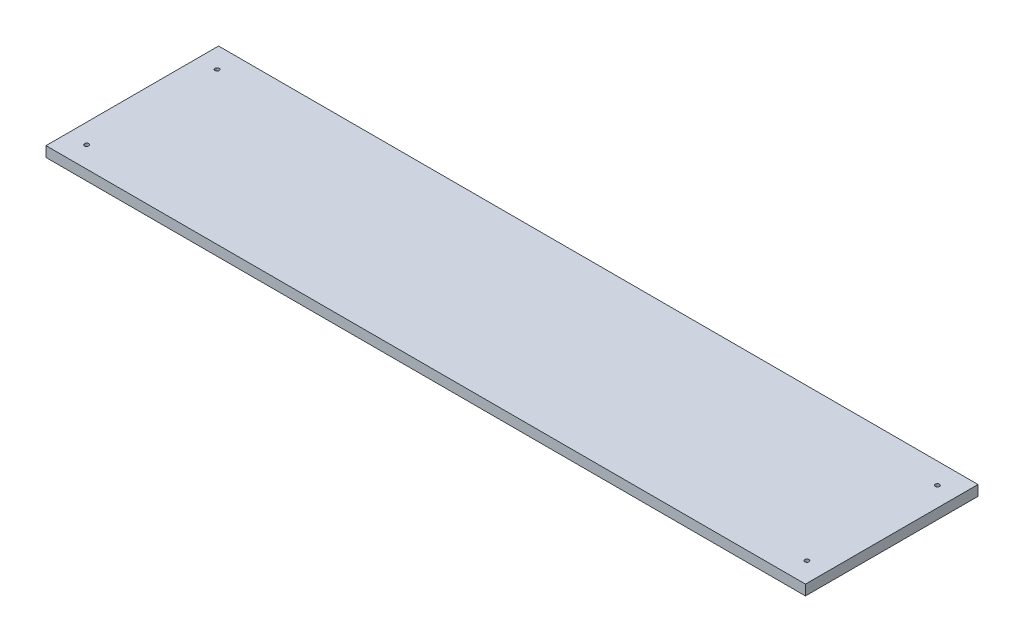
ISO-10303-21;
HEADER;
FILE_DESCRIPTION(('STEP AP214'),'2;1');
FILE_NAME('part.step','',(''),(''),'','','');
FILE_SCHEMA(('AUTOMOTIVE_DESIGN { 1 0 10303 214 1 1 1 1 }'));
ENDSEC;
DATA;
#1=APPLICATION_CONTEXT('core data for automotive mechanical design processes');
#2=APPLICATION_PROTOCOL_DEFINITION('international standard','automotive_design',2000,#1);
#3=PRODUCT_CONTEXT('',#1,'mechanical');
#4=PRODUCT('Part','Part','',(#3));
#5=PRODUCT_RELATED_PRODUCT_CATEGORY('part','',(#4));
#6=PRODUCT_DEFINITION_FORMATION('','',#4);
#7=PRODUCT_DEFINITION_CONTEXT('part definition',#1,'design');
#8=PRODUCT_DEFINITION('design','',#6,#7);
#9=PRODUCT_DEFINITION_SHAPE('','',#8);
#10=(LENGTH_UNIT() NAMED_UNIT(*) SI_UNIT(.MILLI.,.METRE.));
#11=(NAMED_UNIT(*) PLANE_ANGLE_UNIT() SI_UNIT($,.RADIAN.));
#12=(NAMED_UNIT(*) SI_UNIT($,.STERADIAN.) SOLID_ANGLE_UNIT());
#13=UNCERTAINTY_MEASURE_WITH_UNIT(LENGTH_MEASURE(1.E-05),#10,'distance_accuracy_value','');
#14=(GEOMETRIC_REPRESENTATION_CONTEXT(3) GLOBAL_UNCERTAINTY_ASSIGNED_CONTEXT((#13)) GLOBAL_UNIT_ASSIGNED_CONTEXT((#10,
#11,#12)) REPRESENTATION_CONTEXT('',''));
#15=CARTESIAN_POINT('',(0.,0.,0.));
#16=DIRECTION('',(0.,0.,1.));
#17=DIRECTION('',(1.,0.,0.));
#18=AXIS2_PLACEMENT_3D('',#15,#16,#17);
#19=CARTESIAN_POINT('',(0.,10.,0.));
#20=DIRECTION('',(0.,1.,0.));
#21=DIRECTION('',(0.,0.,1.));
#22=AXIS2_PLACEMENT_3D('',#19,#20,#21);
#23=PLANE('',#22);
#24=CARTESIAN_POINT('',(385.07374301676,10.,-46.4614525139665));
#25=DIRECTION('',(0.,1.,0.));
#26=DIRECTION('',(0.,0.,1.));
#27=AXIS2_PLACEMENT_3D('',#24,#25,#26);
#28=CIRCLE('',#27,2.);
#29=CARTESIAN_POINT('',(385.07374301676,10.,-44.4614525139665));
#30=VERTEX_POINT('',#29);
#31=EDGE_CURVE('E691',#30,#30,#28,.T.);
#32=ORIENTED_EDGE('',*,*,#31,.F.);
#33=EDGE_LOOP('',(#32));
#34=FACE_BOUND('',#33,.T.);
#35=CARTESIAN_POINT('',(385.07374301676,10.,-173.061452513967));
#36=DIRECTION('',(0.,-1.,0.));
#37=DIRECTION('',(0.,0.,-1.));
#38=AXIS2_PLACEMENT_3D('',#35,#36,#37);
#39=CIRCLE('',#38,2.);
#40=CARTESIAN_POINT('',(385.07374301676,10.,-175.061452513967));
#41=VERTEX_POINT('',#40);
#42=EDGE_CURVE('E682',#41,#41,#39,.T.);
#43=ORIENTED_EDGE('',*,*,#42,.T.);
#44=EDGE_LOOP('',(#43));
#45=FACE_BOUND('',#44,.T.);
#46=DIRECTION('',(0.,0.,1.));
#47=VECTOR('',#46,1.);
#48=CARTESIAN_POINT('',(-332.72625698324,10.,-193.461452513966));
#49=LINE('',#48,#47);
#50=CARTESIAN_POINT('',(-332.72625698324,10.,-193.461452513966));
#51=VERTEX_POINT('',#50);
#52=CARTESIAN_POINT('',(-332.72625698324,10.,-26.0614525139665));
#53=VERTEX_POINT('',#52);
#54=EDGE_CURVE('E356',#51,#53,#49,.T.);
#55=ORIENTED_EDGE('',*,*,#54,.T.);
#56=DIRECTION('',(1.,0.,0.));
#57=VECTOR('',#56,1.);
#58=CARTESIAN_POINT('',(-332.72625698324,10.,-26.0614525139665));
#59=LINE('',#58,#57);
#60=CARTESIAN_POINT('',(404.07374301676,10.,-26.0614525139665));
#61=VERTEX_POINT('',#60);
#62=EDGE_CURVE('E360',#53,#61,#59,.T.);
#63=ORIENTED_EDGE('',*,*,#62,.T.);
#64=DIRECTION('',(0.,0.,-1.));
#65=VECTOR('',#64,1.);
#66=CARTESIAN_POINT('',(404.07374301676,10.,-193.461452513966));
#67=LINE('',#66,#65);
#68=CARTESIAN_POINT('',(404.07374301676,10.,-193.461452513966));
#69=VERTEX_POINT('',#68);
#70=EDGE_CURVE('E364',#61,#69,#67,.T.);
#71=ORIENTED_EDGE('',*,*,#70,.T.);
#72=DIRECTION('',(-1.,0.,0.));
#73=VECTOR('',#72,1.);
#74=CARTESIAN_POINT('',(-332.72625698324,10.,-193.461452513966));
#75=LINE('',#74,#73);
#76=EDGE_CURVE('E367',#69,#51,#75,.T.);
#77=ORIENTED_EDGE('',*,*,#76,.T.);
#78=EDGE_LOOP('',(#55,#63,#71,#77));
#79=FACE_BOUND('',#78,.T.);
#80=CARTESIAN_POINT('',(-313.72625698324,10.,-46.4614525139665));
#81=DIRECTION('',(0.,-1.,0.));
#82=DIRECTION('',(0.,0.,-1.));
#83=AXIS2_PLACEMENT_3D('',#80,#81,#82);
#84=CIRCLE('',#83,2.);
#85=CARTESIAN_POINT('',(-313.72625698324,10.,-48.4614525139665));
#86=VERTEX_POINT('',#85);
#87=EDGE_CURVE('E671',#86,#86,#84,.T.);
#88=ORIENTED_EDGE('',*,*,#87,.T.);
#89=EDGE_LOOP('',(#88));
#90=FACE_BOUND('',#89,.T.);
#91=CARTESIAN_POINT('',(-313.72625698324,10.,-173.061452513967));
#92=DIRECTION('',(0.,1.,0.));
#93=DIRECTION('',(0.,0.,1.));
#94=AXIS2_PLACEMENT_3D('',#91,#92,#93);
#95=CIRCLE('',#94,2.);
#96=CARTESIAN_POINT('',(-313.72625698324,10.,-171.061452513967));
#97=VERTEX_POINT('',#96);
#98=EDGE_CURVE('E674',#97,#97,#95,.T.);
#99=ORIENTED_EDGE('',*,*,#98,.F.);
#100=EDGE_LOOP('',(#99));
#101=FACE_BOUND('',#100,.T.);
#102=ADVANCED_FACE('F71',(#34,#45,#79,#90,#101),#23,.T.);
#103=CARTESIAN_POINT('',(0.,5.,0.));
#104=DIRECTION('',(0.,-1.,0.));
#105=DIRECTION('',(0.,0.,-1.));
#106=AXIS2_PLACEMENT_3D('',#103,#104,#105);
#107=PLANE('',#106);
#108=CARTESIAN_POINT('',(385.07374301676,5.,-46.4614525139665));
#109=DIRECTION('',(0.,-1.,0.));
#110=DIRECTION('',(0.,0.,-1.));
#111=AXIS2_PLACEMENT_3D('',#108,#109,#110);
#112=CIRCLE('',#111,3.99999999999999);
#113=CARTESIAN_POINT('',(385.07374301676,5.,-50.4614525139665));
#114=VERTEX_POINT('',#113);
#115=EDGE_CURVE('E275',#114,#114,#112,.F.);
#116=ORIENTED_EDGE('',*,*,#115,.T.);
#117=EDGE_LOOP('',(#116));
#118=FACE_BOUND('',#117,.T.);
#119=CARTESIAN_POINT('',(-313.72625698324,5.,-173.061452513967));
#120=DIRECTION('',(0.,-1.,0.));
#121=DIRECTION('',(0.,0.,-1.));
#122=AXIS2_PLACEMENT_3D('',#119,#120,#121);
#123=CIRCLE('',#122,3.99999999999999);
#124=CARTESIAN_POINT('',(-313.72625698324,5.,-177.061452513967));
#125=VERTEX_POINT('',#124);
#126=EDGE_CURVE('E496',#125,#125,#123,.F.);
#127=ORIENTED_EDGE('',*,*,#126,.T.);
#128=EDGE_LOOP('',(#127));
#129=FACE_BOUND('',#128,.T.);
#130=DIRECTION('',(0.,0.,-1.));
#131=VECTOR('',#130,1.);
#132=CARTESIAN_POINT('',(-321.22625698324,5.,-37.5614525139665));
#133=LINE('',#132,#131);
#134=CARTESIAN_POINT('',(-321.22625698324,5.,-37.5614525139665));
#135=VERTEX_POINT('',#134);
#136=CARTESIAN_POINT('',(-321.22625698324,5.,-178.961452513966));
#137=VERTEX_POINT('',#136);
#138=EDGE_CURVE('E250',#135,#137,#133,.T.);
#139=ORIENTED_EDGE('',*,*,#138,.T.);
#140=CARTESIAN_POINT('',(-318.22625698324,5.,-178.961452513966));
#141=DIRECTION('',(0.,-1.,0.));
#142=DIRECTION('',(0.,0.,-1.));
#143=AXIS2_PLACEMENT_3D('',#140,#141,#142);
#144=CIRCLE('',#143,3.);
#145=CARTESIAN_POINT('',(-318.22625698324,5.,-181.961452513966));
#146=VERTEX_POINT('',#145);
#147=EDGE_CURVE('E245',#137,#146,#144,.T.);
#148=ORIENTED_EDGE('',*,*,#147,.T.);
#149=DIRECTION('',(1.,0.,0.));
#150=VECTOR('',#149,1.);
#151=CARTESIAN_POINT('',(-321.22625698324,5.,-181.961452513966));
#152=LINE('',#151,#150);
#153=CARTESIAN_POINT('',(392.57374301676,5.,-181.961452513966));
#154=VERTEX_POINT('',#153);
#155=EDGE_CURVE('E235',#146,#154,#152,.T.);
#156=ORIENTED_EDGE('',*,*,#155,.T.);
#157=DIRECTION('',(0.,0.,1.));
#158=VECTOR('',#157,1.);
#159=CARTESIAN_POINT('',(392.57374301676,5.,-37.5614525139665));
#160=LINE('',#159,#158);
#161=CARTESIAN_POINT('',(392.57374301676,5.,-37.5614525139665));
#162=VERTEX_POINT('',#161);
#163=EDGE_CURVE('E242',#154,#162,#160,.T.);
#164=ORIENTED_EDGE('',*,*,#163,.T.);
#165=DIRECTION('',(-1.,0.,0.));
#166=VECTOR('',#165,1.);
#167=CARTESIAN_POINT('',(-321.22625698324,5.,-37.5614525139665));
#168=LINE('',#167,#166);
#169=EDGE_CURVE('E262',#162,#135,#168,.T.);
#170=ORIENTED_EDGE('',*,*,#169,.T.);
#171=EDGE_LOOP('',(#139,#148,#156,#164,#170));
#172=FACE_BOUND('',#171,.T.);
#173=CARTESIAN_POINT('',(-313.72625698324,5.,-46.4614525139665));
#174=DIRECTION('',(0.,-1.,0.));
#175=DIRECTION('',(0.,0.,-1.));
#176=AXIS2_PLACEMENT_3D('',#173,#174,#175);
#177=CIRCLE('',#176,3.99999999999999);
#178=CARTESIAN_POINT('',(-313.72625698324,5.,-50.4614525139665));
#179=VERTEX_POINT('',#178);
#180=EDGE_CURVE('E80',#179,#179,#177,.T.);
#181=ORIENTED_EDGE('',*,*,#180,.F.);
#182=EDGE_LOOP('',(#181));
#183=FACE_BOUND('',#182,.T.);
#184=CARTESIAN_POINT('',(385.07374301676,5.,-173.061452513967));
#185=DIRECTION('',(0.,-1.,0.));
#186=DIRECTION('',(0.,0.,-1.));
#187=AXIS2_PLACEMENT_3D('',#184,#185,#186);
#188=CIRCLE('',#187,3.99999999999999);
#189=CARTESIAN_POINT('',(385.07374301676,5.,-177.061452513967));
#190=VERTEX_POINT('',#189);
#191=EDGE_CURVE('E12',#190,#190,#188,.T.);
#192=ORIENTED_EDGE('',*,*,#191,.F.);
#193=EDGE_LOOP('',(#192));
#194=FACE_BOUND('',#193,.T.);
#195=ADVANCED_FACE('F238',(#118,#129,#172,#183,#194),#107,.T.);
#196=CARTESIAN_POINT('',(-332.72625698324,10.,-193.461452513966));
#197=DIRECTION('',(1.,0.,0.));
#198=DIRECTION('',(0.,0.,-1.));
#199=AXIS2_PLACEMENT_3D('',#196,#197,#198);
#200=PLANE('',#199);
#201=DIRECTION('',(0.,0.,1.));
#202=VECTOR('',#201,1.);
#203=CARTESIAN_POINT('',(-332.72625698324,0.,-193.461452513966));
#204=LINE('',#203,#202);
#205=CARTESIAN_POINT('',(-332.72625698324,0.,-193.461452513966));
#206=VERTEX_POINT('',#205);
#207=CARTESIAN_POINT('',(-332.72625698324,0.,-26.0614525139665));
#208=VERTEX_POINT('',#207);
#209=EDGE_CURVE('E342',#206,#208,#204,.T.);
#210=ORIENTED_EDGE('',*,*,#209,.T.);
#211=DIRECTION('',(0.,-1.,0.));
#212=VECTOR('',#211,1.);
#213=CARTESIAN_POINT('',(-332.72625698324,10.,-26.0614525139665));
#214=LINE('',#213,#212);
#215=EDGE_CURVE('E393',#53,#208,#214,.T.);
#216=ORIENTED_EDGE('',*,*,#215,.F.);
#217=ORIENTED_EDGE('',*,*,#54,.F.);
#218=DIRECTION('',(0.,-1.,0.));
#219=VECTOR('',#218,1.);
#220=CARTESIAN_POINT('',(-332.72625698324,10.,-193.461452513966));
#221=LINE('',#220,#219);
#222=EDGE_CURVE('E370',#51,#206,#221,.T.);
#223=ORIENTED_EDGE('',*,*,#222,.T.);
#224=EDGE_LOOP('',(#210,#216,#217,#223));
#225=FACE_BOUND('',#224,.T.);
#226=ADVANCED_FACE('F511',(#225),#200,.F.);
#227=CARTESIAN_POINT('',(-332.72625698324,10.,-26.0614525139665));
#228=DIRECTION('',(0.,0.,-1.));
#229=DIRECTION('',(-1.,0.,0.));
#230=AXIS2_PLACEMENT_3D('',#227,#228,#229);
#231=PLANE('',#230);
#232=DIRECTION('',(1.,0.,0.));
#233=VECTOR('',#232,1.);
#234=CARTESIAN_POINT('',(-332.72625698324,0.,-26.0614525139665));
#235=LINE('',#234,#233);
#236=CARTESIAN_POINT('',(404.07374301676,0.,-26.0614525139665));
#237=VERTEX_POINT('',#236);
#238=EDGE_CURVE('E374',#208,#237,#235,.T.);
#239=ORIENTED_EDGE('',*,*,#238,.T.);
#240=DIRECTION('',(0.,-1.,0.));
#241=VECTOR('',#240,1.);
#242=CARTESIAN_POINT('',(404.07374301676,10.,-26.0614525139665));
#243=LINE('',#242,#241);
#244=EDGE_CURVE('E389',#61,#237,#243,.T.);
#245=ORIENTED_EDGE('',*,*,#244,.F.);
#246=ORIENTED_EDGE('',*,*,#62,.F.);
#247=ORIENTED_EDGE('',*,*,#215,.T.);
#248=EDGE_LOOP('',(#239,#245,#246,#247));
#249=FACE_BOUND('',#248,.T.);
#250=ADVANCED_FACE('F594',(#249),#231,.F.);
#251=CARTESIAN_POINT('',(404.07374301676,10.,-193.461452513966));
#252=DIRECTION('',(-1.,0.,0.));
#253=DIRECTION('',(0.,0.,1.));
#254=AXIS2_PLACEMENT_3D('',#251,#252,#253);
#255=PLANE('',#254);
#256=DIRECTION('',(0.,0.,-1.));
#257=VECTOR('',#256,1.);
#258=CARTESIAN_POINT('',(404.07374301676,0.,-193.461452513966));
#259=LINE('',#258,#257);
#260=CARTESIAN_POINT('',(404.07374301676,0.,-193.461452513966));
#261=VERTEX_POINT('',#260);
#262=EDGE_CURVE('E377',#237,#261,#259,.T.);
#263=ORIENTED_EDGE('',*,*,#262,.T.);
#264=DIRECTION('',(0.,-1.,0.));
#265=VECTOR('',#264,1.);
#266=CARTESIAN_POINT('',(404.07374301676,10.,-193.461452513966));
#267=LINE('',#266,#265);
#268=EDGE_CURVE('E385',#69,#261,#267,.T.);
#269=ORIENTED_EDGE('',*,*,#268,.F.);
#270=ORIENTED_EDGE('',*,*,#70,.F.);
#271=ORIENTED_EDGE('',*,*,#244,.T.);
#272=EDGE_LOOP('',(#263,#269,#270,#271));
#273=FACE_BOUND('',#272,.T.);
#274=ADVANCED_FACE('F590',(#273),#255,.F.);
#275=CARTESIAN_POINT('',(-332.72625698324,10.,-193.461452513966));
#276=DIRECTION('',(0.,0.,1.));
#277=DIRECTION('',(1.,0.,0.));
#278=AXIS2_PLACEMENT_3D('',#275,#276,#277);
#279=PLANE('',#278);
#280=DIRECTION('',(-1.,0.,0.));
#281=VECTOR('',#280,1.);
#282=CARTESIAN_POINT('',(-332.72625698324,0.,-193.461452513966));
#283=LINE('',#282,#281);
#284=EDGE_CURVE('E361',#261,#206,#283,.T.);
#285=ORIENTED_EDGE('',*,*,#284,.T.);
#286=ORIENTED_EDGE('',*,*,#222,.F.);
#287=ORIENTED_EDGE('',*,*,#76,.F.);
#288=ORIENTED_EDGE('',*,*,#268,.T.);
#289=EDGE_LOOP('',(#285,#286,#287,#288));
#290=FACE_BOUND('',#289,.T.);
#291=ADVANCED_FACE('F587',(#290),#279,.F.);
#292=CARTESIAN_POINT('',(0.,0.,0.));
#293=DIRECTION('',(0.,1.,0.));
#294=DIRECTION('',(0.,0.,1.));
#295=AXIS2_PLACEMENT_3D('',#292,#293,#294);
#296=PLANE('',#295);
#297=DIRECTION('',(1.,0.,0.));
#298=VECTOR('',#297,1.);
#299=CARTESIAN_POINT('',(-327.72625698324,0.,-189.961452513966));
#300=LINE('',#299,#298);
#301=CARTESIAN_POINT('',(-326.22625698324,0.,-189.961452513966));
#302=VERTEX_POINT('',#301);
#303=CARTESIAN_POINT('',(397.57374301676,0.,-189.961452513966));
#304=VERTEX_POINT('',#303);
#305=EDGE_CURVE('E346',#302,#304,#300,.T.);
#306=ORIENTED_EDGE('',*,*,#305,.F.);
#307=CARTESIAN_POINT('',(-326.22625698324,0.,-186.961452513966));
#308=DIRECTION('',(0.,1.,0.));
#309=DIRECTION('',(0.,0.,1.));
#310=AXIS2_PLACEMENT_3D('',#307,#308,#309);
#311=CIRCLE('',#310,3.);
#312=CARTESIAN_POINT('',(-329.22625698324,0.,-186.961452513966));
#313=VERTEX_POINT('',#312);
#314=EDGE_CURVE('E477',#302,#313,#311,.T.);
#315=ORIENTED_EDGE('',*,*,#314,.T.);
#316=DIRECTION('',(0.,0.,-1.));
#317=VECTOR('',#316,1.);
#318=CARTESIAN_POINT('',(-329.22625698324,0.,-31.0614525139665));
#319=LINE('',#318,#317);
#320=CARTESIAN_POINT('',(-329.22625698324,0.,-32.5614525139665));
#321=VERTEX_POINT('',#320);
#322=EDGE_CURVE('E324',#321,#313,#319,.T.);
#323=ORIENTED_EDGE('',*,*,#322,.F.);
#324=CARTESIAN_POINT('',(-326.22625698324,0.,-32.5614525139665));
#325=DIRECTION('',(0.,1.,0.));
#326=DIRECTION('',(0.,0.,1.));
#327=AXIS2_PLACEMENT_3D('',#324,#325,#326);
#328=CIRCLE('',#327,3.);
#329=CARTESIAN_POINT('',(-326.22625698324,0.,-29.5614525139665));
#330=VERTEX_POINT('',#329);
#331=EDGE_CURVE('E480',#321,#330,#328,.T.);
#332=ORIENTED_EDGE('',*,*,#331,.T.);
#333=DIRECTION('',(-1.,0.,0.));
#334=VECTOR('',#333,1.);
#335=CARTESIAN_POINT('',(-327.72625698324,0.,-29.5614525139665));
#336=LINE('',#335,#334);
#337=CARTESIAN_POINT('',(397.57374301676,0.,-29.5614525139665));
#338=VERTEX_POINT('',#337);
#339=EDGE_CURVE('E330',#338,#330,#336,.T.);
#340=ORIENTED_EDGE('',*,*,#339,.F.);
#341=CARTESIAN_POINT('',(397.57374301676,0.,-32.5614525139665));
#342=DIRECTION('',(0.,1.,0.));
#343=DIRECTION('',(0.,0.,1.));
#344=AXIS2_PLACEMENT_3D('',#341,#342,#343);
#345=CIRCLE('',#344,3.);
#346=CARTESIAN_POINT('',(400.57374301676,0.,-32.5614525139665));
#347=VERTEX_POINT('',#346);
#348=EDGE_CURVE('E87',#338,#347,#345,.T.);
#349=ORIENTED_EDGE('',*,*,#348,.T.);
#350=DIRECTION('',(0.,0.,1.));
#351=VECTOR('',#350,1.);
#352=CARTESIAN_POINT('',(400.57374301676,0.,-31.0614525139665));
#353=LINE('',#352,#351);
#354=CARTESIAN_POINT('',(400.57374301676,0.,-186.961452513966));
#355=VERTEX_POINT('',#354);
#356=EDGE_CURVE('E350',#355,#347,#353,.T.);
#357=ORIENTED_EDGE('',*,*,#356,.F.);
#358=CARTESIAN_POINT('',(397.57374301676,0.,-186.961452513966));
#359=DIRECTION('',(0.,1.,0.));
#360=DIRECTION('',(0.,0.,1.));
#361=AXIS2_PLACEMENT_3D('',#358,#359,#360);
#362=CIRCLE('',#361,3.);
#363=EDGE_CURVE('E95',#355,#304,#362,.T.);
#364=ORIENTED_EDGE('',*,*,#363,.T.);
#365=EDGE_LOOP('',(#306,#315,#323,#332,#340,#349,#357,#364));
#366=FACE_BOUND('',#365,.T.);
#367=ORIENTED_EDGE('',*,*,#209,.F.);
#368=ORIENTED_EDGE('',*,*,#284,.F.);
#369=ORIENTED_EDGE('',*,*,#262,.F.);
#370=ORIENTED_EDGE('',*,*,#238,.F.);
#371=EDGE_LOOP('',(#367,#368,#369,#370));
#372=FACE_BOUND('',#371,.T.);
#373=ADVANCED_FACE('F570',(#366,#372),#296,.F.);
#374=CARTESIAN_POINT('',(-329.22625698324,3.,-31.0614525139665));
#375=DIRECTION('',(-1.,0.,0.));
#376=DIRECTION('',(0.,0.,1.));
#377=AXIS2_PLACEMENT_3D('',#374,#375,#376);
#378=PLANE('',#377);
#379=ORIENTED_EDGE('',*,*,#322,.T.);
#380=DIRECTION('',(0.,-1.,0.));
#381=VECTOR('',#380,1.);
#382=CARTESIAN_POINT('',(-329.22625698324,3.,-186.961452513966));
#383=LINE('',#382,#381);
#384=CARTESIAN_POINT('',(-329.22625698324,3.,-186.961452513966));
#385=VERTEX_POINT('',#384);
#386=EDGE_CURVE('E416',#313,#385,#383,.F.);
#387=ORIENTED_EDGE('',*,*,#386,.T.);
#388=DIRECTION('',(0.,0.,-1.));
#389=VECTOR('',#388,1.);
#390=CARTESIAN_POINT('',(-329.22625698324,3.,-31.0614525139665));
#391=LINE('',#390,#389);
#392=CARTESIAN_POINT('',(-329.22625698324,3.,-32.5614525139665));
#393=VERTEX_POINT('',#392);
#394=EDGE_CURVE('E325',#393,#385,#391,.T.);
#395=ORIENTED_EDGE('',*,*,#394,.F.);
#396=DIRECTION('',(0.,-1.,0.));
#397=VECTOR('',#396,1.);
#398=CARTESIAN_POINT('',(-329.22625698324,0.,-32.5614525139665));
#399=LINE('',#398,#397);
#400=EDGE_CURVE('E412',#393,#321,#399,.T.);
#401=ORIENTED_EDGE('',*,*,#400,.T.);
#402=EDGE_LOOP('',(#379,#387,#395,#401));
#403=FACE_BOUND('',#402,.T.);
#404=ADVANCED_FACE('F583',(#403),#378,.F.);
#405=CARTESIAN_POINT('',(-327.72625698324,3.,-29.5614525139665));
#406=DIRECTION('',(0.,0.,1.));
#407=DIRECTION('',(1.,0.,0.));
#408=AXIS2_PLACEMENT_3D('',#405,#406,#407);
#409=PLANE('',#408);
#410=ORIENTED_EDGE('',*,*,#339,.T.);
#411=DIRECTION('',(0.,-1.,0.));
#412=VECTOR('',#411,1.);
#413=CARTESIAN_POINT('',(-326.22625698324,3.,-29.5614525139665));
#414=LINE('',#413,#412);
#415=CARTESIAN_POINT('',(-326.22625698324,3.,-29.5614525139665));
#416=VERTEX_POINT('',#415);
#417=EDGE_CURVE('E435',#330,#416,#414,.F.);
#418=ORIENTED_EDGE('',*,*,#417,.T.);
#419=DIRECTION('',(-1.,0.,0.));
#420=VECTOR('',#419,1.);
#421=CARTESIAN_POINT('',(-327.72625698324,3.,-29.5614525139665));
#422=LINE('',#421,#420);
#423=CARTESIAN_POINT('',(397.57374301676,3.,-29.5614525139665));
#424=VERTEX_POINT('',#423);
#425=EDGE_CURVE('E338',#424,#416,#422,.T.);
#426=ORIENTED_EDGE('',*,*,#425,.F.);
#427=DIRECTION('',(0.,-1.,0.));
#428=VECTOR('',#427,1.);
#429=CARTESIAN_POINT('',(397.57374301676,0.,-29.5614525139665));
#430=LINE('',#429,#428);
#431=EDGE_CURVE('E431',#424,#338,#430,.T.);
#432=ORIENTED_EDGE('',*,*,#431,.T.);
#433=EDGE_LOOP('',(#410,#418,#426,#432));
#434=FACE_BOUND('',#433,.T.);
#435=ADVANCED_FACE('F643',(#434),#409,.F.);
#436=CARTESIAN_POINT('',(400.57374301676,3.,-31.0614525139665));
#437=DIRECTION('',(1.,0.,0.));
#438=DIRECTION('',(0.,0.,-1.));
#439=AXIS2_PLACEMENT_3D('',#436,#437,#438);
#440=PLANE('',#439);
#441=ORIENTED_EDGE('',*,*,#356,.T.);
#442=DIRECTION('',(0.,-1.,0.));
#443=VECTOR('',#442,1.);
#444=CARTESIAN_POINT('',(400.57374301676,3.,-32.5614525139665));
#445=LINE('',#444,#443);
#446=CARTESIAN_POINT('',(400.57374301676,3.,-32.5614525139665));
#447=VERTEX_POINT('',#446);
#448=EDGE_CURVE('E467',#347,#447,#445,.F.);
#449=ORIENTED_EDGE('',*,*,#448,.T.);
#450=DIRECTION('',(0.,0.,1.));
#451=VECTOR('',#450,1.);
#452=CARTESIAN_POINT('',(400.57374301676,3.,-31.0614525139665));
#453=LINE('',#452,#451);
#454=CARTESIAN_POINT('',(400.57374301676,3.,-186.961452513966));
#455=VERTEX_POINT('',#454);
#456=EDGE_CURVE('E334',#455,#447,#453,.T.);
#457=ORIENTED_EDGE('',*,*,#456,.F.);
#458=DIRECTION('',(0.,-1.,0.));
#459=VECTOR('',#458,1.);
#460=CARTESIAN_POINT('',(400.57374301676,0.,-186.961452513966));
#461=LINE('',#460,#459);
#462=EDGE_CURVE('E464',#455,#355,#461,.T.);
#463=ORIENTED_EDGE('',*,*,#462,.T.);
#464=EDGE_LOOP('',(#441,#449,#457,#463));
#465=FACE_BOUND('',#464,.T.);
#466=ADVANCED_FACE('F637',(#465),#440,.F.);
#467=CARTESIAN_POINT('',(-327.72625698324,3.,-189.961452513966));
#468=DIRECTION('',(0.,0.,-1.));
#469=DIRECTION('',(-1.,0.,0.));
#470=AXIS2_PLACEMENT_3D('',#467,#468,#469);
#471=PLANE('',#470);
#472=DIRECTION('',(1.,0.,0.));
#473=VECTOR('',#472,1.);
#474=CARTESIAN_POINT('',(-327.72625698324,3.,-189.961452513966));
#475=LINE('',#474,#473);
#476=CARTESIAN_POINT('',(-326.22625698324,3.,-189.961452513966));
#477=VERTEX_POINT('',#476);
#478=CARTESIAN_POINT('',(397.57374301676,3.,-189.961452513966));
#479=VERTEX_POINT('',#478);
#480=EDGE_CURVE('E329',#477,#479,#475,.T.);
#481=ORIENTED_EDGE('',*,*,#480,.F.);
#482=DIRECTION('',(0.,-1.,0.));
#483=VECTOR('',#482,1.);
#484=CARTESIAN_POINT('',(-326.22625698324,0.,-189.961452513966));
#485=LINE('',#484,#483);
#486=EDGE_CURVE('E408',#477,#302,#485,.T.);
#487=ORIENTED_EDGE('',*,*,#486,.T.);
#488=ORIENTED_EDGE('',*,*,#305,.T.);
#489=DIRECTION('',(0.,-1.,0.));
#490=VECTOR('',#489,1.);
#491=CARTESIAN_POINT('',(397.57374301676,3.,-189.961452513966));
#492=LINE('',#491,#490);
#493=EDGE_CURVE('E405',#304,#479,#492,.F.);
#494=ORIENTED_EDGE('',*,*,#493,.T.);
#495=EDGE_LOOP('',(#481,#487,#488,#494));
#496=FACE_BOUND('',#495,.T.);
#497=ADVANCED_FACE('F653',(#496),#471,.F.);
#498=CARTESIAN_POINT('',(0.,3.,0.));
#499=DIRECTION('',(0.,-1.,0.));
#500=DIRECTION('',(0.,0.,-1.));
#501=AXIS2_PLACEMENT_3D('',#498,#499,#500);
#502=PLANE('',#501);
#503=DIRECTION('',(-1.,0.,0.));
#504=VECTOR('',#503,1.);
#505=CARTESIAN_POINT('',(-327.72625698324,3.,-32.5614525139665));
#506=LINE('',#505,#504);
#507=CARTESIAN_POINT('',(394.57374301676,3.,-32.5614525139665));
#508=VERTEX_POINT('',#507);
#509=CARTESIAN_POINT('',(-323.22625698324,3.,-32.5614525139665));
#510=VERTEX_POINT('',#509);
#511=EDGE_CURVE('E303',#508,#510,#506,.T.);
#512=ORIENTED_EDGE('',*,*,#511,.F.);
#513=CARTESIAN_POINT('',(394.57374301676,3.,-35.5614525139665));
#514=DIRECTION('',(0.,-1.,0.));
#515=DIRECTION('',(0.,0.,-1.));
#516=AXIS2_PLACEMENT_3D('',#513,#514,#515);
#517=CIRCLE('',#516,3.);
#518=CARTESIAN_POINT('',(397.57374301676,3.,-35.5614525139665));
#519=VERTEX_POINT('',#518);
#520=EDGE_CURVE('E486',#508,#519,#517,.F.);
#521=ORIENTED_EDGE('',*,*,#520,.T.);
#522=DIRECTION('',(0.,0.,1.));
#523=VECTOR('',#522,1.);
#524=CARTESIAN_POINT('',(397.57374301676,3.,-31.0614525139665));
#525=LINE('',#524,#523);
#526=CARTESIAN_POINT('',(397.57374301676,3.,-183.961452513966));
#527=VERTEX_POINT('',#526);
#528=EDGE_CURVE('E299',#527,#519,#525,.T.);
#529=ORIENTED_EDGE('',*,*,#528,.F.);
#530=CARTESIAN_POINT('',(394.57374301676,3.,-183.961452513966));
#531=DIRECTION('',(0.,-1.,0.));
#532=DIRECTION('',(0.,0.,-1.));
#533=AXIS2_PLACEMENT_3D('',#530,#531,#532);
#534=CIRCLE('',#533,3.);
#535=CARTESIAN_POINT('',(394.57374301676,3.,-186.961452513966));
#536=VERTEX_POINT('',#535);
#537=EDGE_CURVE('E493',#527,#536,#534,.F.);
#538=ORIENTED_EDGE('',*,*,#537,.T.);
#539=DIRECTION('',(1.,0.,0.));
#540=VECTOR('',#539,1.);
#541=CARTESIAN_POINT('',(-327.72625698324,3.,-186.961452513966));
#542=LINE('',#541,#540);
#543=CARTESIAN_POINT('',(-326.22625698324,3.,-186.961452513966));
#544=VERTEX_POINT('',#543);
#545=EDGE_CURVE('E294',#544,#536,#542,.T.);
#546=ORIENTED_EDGE('',*,*,#545,.F.);
#547=DIRECTION('',(0.,0.,-1.));
#548=VECTOR('',#547,1.);
#549=CARTESIAN_POINT('',(-326.22625698324,3.,-31.0614525139665));
#550=LINE('',#549,#548);
#551=CARTESIAN_POINT('',(-326.22625698324,3.,-35.5614525139665));
#552=VERTEX_POINT('',#551);
#553=EDGE_CURVE('E291',#552,#544,#550,.T.);
#554=ORIENTED_EDGE('',*,*,#553,.F.);
#555=CARTESIAN_POINT('',(-323.22625698324,3.,-35.5614525139665));
#556=DIRECTION('',(0.,-1.,0.));
#557=DIRECTION('',(0.,0.,-1.));
#558=AXIS2_PLACEMENT_3D('',#555,#556,#557);
#559=CIRCLE('',#558,3.);
#560=EDGE_CURVE('E483',#552,#510,#559,.F.);
#561=ORIENTED_EDGE('',*,*,#560,.T.);
#562=EDGE_LOOP('',(#512,#521,#529,#538,#546,#554,#561));
#563=FACE_BOUND('',#562,.T.);
#564=ORIENTED_EDGE('',*,*,#394,.T.);
#565=CARTESIAN_POINT('',(-326.22625698324,3.,-186.961452513966));
#566=DIRECTION('',(0.,-1.,0.));
#567=DIRECTION('',(0.,0.,-1.));
#568=AXIS2_PLACEMENT_3D('',#565,#566,#567);
#569=CIRCLE('',#568,3.);
#570=EDGE_CURVE('E428',#385,#477,#569,.T.);
#571=ORIENTED_EDGE('',*,*,#570,.T.);
#572=ORIENTED_EDGE('',*,*,#480,.T.);
#573=CARTESIAN_POINT('',(397.57374301676,3.,-186.961452513966));
#574=DIRECTION('',(0.,-1.,0.));
#575=DIRECTION('',(0.,0.,-1.));
#576=AXIS2_PLACEMENT_3D('',#573,#574,#575);
#577=CIRCLE('',#576,3.);
#578=EDGE_CURVE('E419',#479,#455,#577,.T.);
#579=ORIENTED_EDGE('',*,*,#578,.T.);
#580=ORIENTED_EDGE('',*,*,#456,.T.);
#581=CARTESIAN_POINT('',(397.57374301676,3.,-32.5614525139665));
#582=DIRECTION('',(0.,-1.,0.));
#583=DIRECTION('',(0.,0.,-1.));
#584=AXIS2_PLACEMENT_3D('',#581,#582,#583);
#585=CIRCLE('',#584,3.);
#586=EDGE_CURVE('E422',#447,#424,#585,.T.);
#587=ORIENTED_EDGE('',*,*,#586,.T.);
#588=ORIENTED_EDGE('',*,*,#425,.T.);
#589=CARTESIAN_POINT('',(-326.22625698324,3.,-32.5614525139665));
#590=DIRECTION('',(0.,-1.,0.));
#591=DIRECTION('',(0.,0.,-1.));
#592=AXIS2_PLACEMENT_3D('',#589,#590,#591);
#593=CIRCLE('',#592,3.);
#594=EDGE_CURVE('E425',#416,#393,#593,.T.);
#595=ORIENTED_EDGE('',*,*,#594,.T.);
#596=EDGE_LOOP('',(#564,#571,#572,#579,#580,#587,#588,#595));
#597=FACE_BOUND('',#596,.T.);
#598=ADVANCED_FACE('F633',(#563,#597),#502,.T.);
#599=CARTESIAN_POINT('',(-326.22625698324,3.,-31.0614525139665));
#600=DIRECTION('',(-1.,0.,0.));
#601=DIRECTION('',(0.,0.,1.));
#602=AXIS2_PLACEMENT_3D('',#599,#600,#601);
#603=PLANE('',#602);
#604=DIRECTION('',(0.,0.,-1.));
#605=VECTOR('',#604,1.);
#606=CARTESIAN_POINT('',(-326.22625698324,0.,-31.0614525139665));
#607=LINE('',#606,#605);
#608=CARTESIAN_POINT('',(-326.22625698324,0.,-35.5614525139665));
#609=VERTEX_POINT('',#608);
#610=CARTESIAN_POINT('',(-326.22625698324,0.,-186.961452513966));
#611=VERTEX_POINT('',#610);
#612=EDGE_CURVE('E288',#609,#611,#607,.T.);
#613=ORIENTED_EDGE('',*,*,#612,.F.);
#614=DIRECTION('',(0.,-1.,0.));
#615=VECTOR('',#614,1.);
#616=CARTESIAN_POINT('',(-326.22625698324,3.,-35.5614525139665));
#617=LINE('',#616,#615);
#618=EDGE_CURVE('E454',#609,#552,#617,.F.);
#619=ORIENTED_EDGE('',*,*,#618,.T.);
#620=ORIENTED_EDGE('',*,*,#553,.T.);
#621=DIRECTION('',(0.,-1.,0.));
#622=VECTOR('',#621,1.);
#623=CARTESIAN_POINT('',(-326.22625698324,3.,-186.961452513966));
#624=LINE('',#623,#622);
#625=EDGE_CURVE('E307',#544,#611,#624,.T.);
#626=ORIENTED_EDGE('',*,*,#625,.T.);
#627=EDGE_LOOP('',(#613,#619,#620,#626));
#628=FACE_BOUND('',#627,.T.);
#629=ADVANCED_FACE('F944',(#628),#603,.T.);
#630=CARTESIAN_POINT('',(-327.72625698324,3.,-32.5614525139665));
#631=DIRECTION('',(0.,0.,1.));
#632=DIRECTION('',(1.,0.,0.));
#633=AXIS2_PLACEMENT_3D('',#630,#631,#632);
#634=PLANE('',#633);
#635=ORIENTED_EDGE('',*,*,#511,.T.);
#636=DIRECTION('',(0.,-1.,0.));
#637=VECTOR('',#636,1.);
#638=CARTESIAN_POINT('',(-323.22625698324,3.,-32.5614525139665));
#639=LINE('',#638,#637);
#640=CARTESIAN_POINT('',(-323.22625698324,0.,-32.5614525139665));
#641=VERTEX_POINT('',#640);
#642=EDGE_CURVE('E441',#510,#641,#639,.T.);
#643=ORIENTED_EDGE('',*,*,#642,.T.);
#644=DIRECTION('',(-1.,0.,0.));
#645=VECTOR('',#644,1.);
#646=CARTESIAN_POINT('',(-327.72625698324,0.,-32.5614525139665));
#647=LINE('',#646,#645);
#648=CARTESIAN_POINT('',(394.57374301676,0.,-32.5614525139665));
#649=VERTEX_POINT('',#648);
#650=EDGE_CURVE('E295',#649,#641,#647,.T.);
#651=ORIENTED_EDGE('',*,*,#650,.F.);
#652=DIRECTION('',(0.,-1.,0.));
#653=VECTOR('',#652,1.);
#654=CARTESIAN_POINT('',(394.57374301676,3.,-32.5614525139665));
#655=LINE('',#654,#653);
#656=EDGE_CURVE('E438',#649,#508,#655,.F.);
#657=ORIENTED_EDGE('',*,*,#656,.T.);
#658=EDGE_LOOP('',(#635,#643,#651,#657));
#659=FACE_BOUND('',#658,.T.);
#660=ADVANCED_FACE('F935',(#659),#634,.T.);
#661=CARTESIAN_POINT('',(397.57374301676,3.,-31.0614525139665));
#662=DIRECTION('',(1.,0.,0.));
#663=DIRECTION('',(0.,0.,-1.));
#664=AXIS2_PLACEMENT_3D('',#661,#662,#663);
#665=PLANE('',#664);
#666=ORIENTED_EDGE('',*,*,#528,.T.);
#667=DIRECTION('',(0.,-1.,0.));
#668=VECTOR('',#667,1.);
#669=CARTESIAN_POINT('',(397.57374301676,3.,-35.5614525139665));
#670=LINE('',#669,#668);
#671=CARTESIAN_POINT('',(397.57374301676,0.,-35.5614525139665));
#672=VERTEX_POINT('',#671);
#673=EDGE_CURVE('E460',#519,#672,#670,.T.);
#674=ORIENTED_EDGE('',*,*,#673,.T.);
#675=DIRECTION('',(0.,0.,1.));
#676=VECTOR('',#675,1.);
#677=CARTESIAN_POINT('',(397.57374301676,0.,-31.0614525139665));
#678=LINE('',#677,#676);
#679=CARTESIAN_POINT('',(397.57374301676,0.,-183.961452513966));
#680=VERTEX_POINT('',#679);
#681=EDGE_CURVE('E314',#680,#672,#678,.T.);
#682=ORIENTED_EDGE('',*,*,#681,.F.);
#683=DIRECTION('',(0.,-1.,0.));
#684=VECTOR('',#683,1.);
#685=CARTESIAN_POINT('',(397.57374301676,3.,-183.961452513966));
#686=LINE('',#685,#684);
#687=EDGE_CURVE('E457',#680,#527,#686,.F.);
#688=ORIENTED_EDGE('',*,*,#687,.T.);
#689=EDGE_LOOP('',(#666,#674,#682,#688));
#690=FACE_BOUND('',#689,.T.);
#691=ADVANCED_FACE('F926',(#690),#665,.T.);
#692=CARTESIAN_POINT('',(-327.72625698324,3.,-186.961452513966));
#693=DIRECTION('',(0.,0.,-1.));
#694=DIRECTION('',(-1.,0.,0.));
#695=AXIS2_PLACEMENT_3D('',#692,#693,#694);
#696=PLANE('',#695);
#697=ORIENTED_EDGE('',*,*,#545,.T.);
#698=DIRECTION('',(0.,-1.,0.));
#699=VECTOR('',#698,1.);
#700=CARTESIAN_POINT('',(394.57374301676,3.,-186.961452513966));
#701=LINE('',#700,#699);
#702=CARTESIAN_POINT('',(394.57374301676,0.,-186.961452513966));
#703=VERTEX_POINT('',#702);
#704=EDGE_CURVE('E470',#536,#703,#701,.T.);
#705=ORIENTED_EDGE('',*,*,#704,.T.);
#706=DIRECTION('',(1.,0.,0.));
#707=VECTOR('',#706,1.);
#708=CARTESIAN_POINT('',(-327.72625698324,0.,-186.961452513966));
#709=LINE('',#708,#707);
#710=EDGE_CURVE('E310',#611,#703,#709,.T.);
#711=ORIENTED_EDGE('',*,*,#710,.F.);
#712=ORIENTED_EDGE('',*,*,#625,.F.);
#713=EDGE_LOOP('',(#697,#705,#711,#712));
#714=FACE_BOUND('',#713,.T.);
#715=ADVANCED_FACE('F568',(#714),#696,.T.);
#716=DIRECTION('',(1.,0.,0.));
#717=VECTOR('',#716,1.);
#718=CARTESIAN_POINT('',(-321.22625698324,0.,-181.961452513966));
#719=LINE('',#718,#717);
#720=CARTESIAN_POINT('',(-318.22625698324,0.,-181.961452513966));
#721=VERTEX_POINT('',#720);
#722=CARTESIAN_POINT('',(392.57374301676,0.,-181.961452513966));
#723=VERTEX_POINT('',#722);
#724=EDGE_CURVE('E256',#721,#723,#719,.T.);
#725=ORIENTED_EDGE('',*,*,#724,.F.);
#726=CARTESIAN_POINT('',(-318.22625698324,0.,-178.961452513966));
#727=DIRECTION('',(0.,1.,0.));
#728=DIRECTION('',(0.,0.,1.));
#729=AXIS2_PLACEMENT_3D('',#726,#727,#728);
#730=CIRCLE('',#729,3.);
#731=CARTESIAN_POINT('',(-321.22625698324,0.,-178.961452513966));
#732=VERTEX_POINT('',#731);
#733=EDGE_CURVE('E474',#721,#732,#730,.T.);
#734=ORIENTED_EDGE('',*,*,#733,.T.);
#735=DIRECTION('',(0.,0.,-1.));
#736=VECTOR('',#735,1.);
#737=CARTESIAN_POINT('',(-321.22625698324,0.,-37.5614525139665));
#738=LINE('',#737,#736);
#739=CARTESIAN_POINT('',(-321.22625698324,0.,-37.5614525139665));
#740=VERTEX_POINT('',#739);
#741=EDGE_CURVE('E271',#740,#732,#738,.T.);
#742=ORIENTED_EDGE('',*,*,#741,.F.);
#743=DIRECTION('',(-1.,0.,0.));
#744=VECTOR('',#743,1.);
#745=CARTESIAN_POINT('',(-321.22625698324,0.,-37.5614525139665));
#746=LINE('',#745,#744);
#747=CARTESIAN_POINT('',(392.57374301676,0.,-37.5614525139665));
#748=VERTEX_POINT('',#747);
#749=EDGE_CURVE('E281',#748,#740,#746,.T.);
#750=ORIENTED_EDGE('',*,*,#749,.F.);
#751=DIRECTION('',(0.,0.,1.));
#752=VECTOR('',#751,1.);
#753=CARTESIAN_POINT('',(392.57374301676,0.,-37.5614525139665));
#754=LINE('',#753,#752);
#755=EDGE_CURVE('E278',#723,#748,#754,.T.);
#756=ORIENTED_EDGE('',*,*,#755,.F.);
#757=EDGE_LOOP('',(#725,#734,#742,#750,#756));
#758=FACE_BOUND('',#757,.T.);
#759=ORIENTED_EDGE('',*,*,#650,.T.);
#760=CARTESIAN_POINT('',(-323.22625698324,0.,-35.5614525139665));
#761=DIRECTION('',(0.,1.,0.));
#762=DIRECTION('',(0.,0.,1.));
#763=AXIS2_PLACEMENT_3D('',#760,#761,#762);
#764=CIRCLE('',#763,3.);
#765=EDGE_CURVE('E451',#641,#609,#764,.F.);
#766=ORIENTED_EDGE('',*,*,#765,.T.);
#767=ORIENTED_EDGE('',*,*,#612,.T.);
#768=ORIENTED_EDGE('',*,*,#710,.T.);
#769=CARTESIAN_POINT('',(394.57374301676,0.,-183.961452513966));
#770=DIRECTION('',(0.,1.,0.));
#771=DIRECTION('',(0.,0.,1.));
#772=AXIS2_PLACEMENT_3D('',#769,#770,#771);
#773=CIRCLE('',#772,3.);
#774=EDGE_CURVE('E445',#703,#680,#773,.F.);
#775=ORIENTED_EDGE('',*,*,#774,.T.);
#776=ORIENTED_EDGE('',*,*,#681,.T.);
#777=CARTESIAN_POINT('',(394.57374301676,0.,-35.5614525139665));
#778=DIRECTION('',(0.,1.,0.));
#779=DIRECTION('',(0.,0.,1.));
#780=AXIS2_PLACEMENT_3D('',#777,#778,#779);
#781=CIRCLE('',#780,3.);
#782=EDGE_CURVE('E448',#672,#649,#781,.F.);
#783=ORIENTED_EDGE('',*,*,#782,.T.);
#784=EDGE_LOOP('',(#759,#766,#767,#768,#775,#776,#783));
#785=FACE_BOUND('',#784,.T.);
#786=ADVANCED_FACE('F553',(#758,#785),#296,.F.);
#787=CARTESIAN_POINT('',(-321.22625698324,5.,-37.5614525139665));
#788=DIRECTION('',(-1.,0.,0.));
#789=DIRECTION('',(0.,0.,1.));
#790=AXIS2_PLACEMENT_3D('',#787,#788,#789);
#791=PLANE('',#790);
#792=ORIENTED_EDGE('',*,*,#741,.T.);
#793=DIRECTION('',(0.,-1.,0.));
#794=VECTOR('',#793,1.);
#795=CARTESIAN_POINT('',(-321.22625698324,5.,-178.961452513966));
#796=LINE('',#795,#794);
#797=EDGE_CURVE('E400',#732,#137,#796,.F.);
#798=ORIENTED_EDGE('',*,*,#797,.T.);
#799=ORIENTED_EDGE('',*,*,#138,.F.);
#800=DIRECTION('',(0.,-1.,0.));
#801=VECTOR('',#800,1.);
#802=CARTESIAN_POINT('',(-321.22625698324,5.,-37.5614525139665));
#803=LINE('',#802,#801);
#804=EDGE_CURVE('E285',#135,#740,#803,.T.);
#805=ORIENTED_EDGE('',*,*,#804,.T.);
#806=EDGE_LOOP('',(#792,#798,#799,#805));
#807=FACE_BOUND('',#806,.T.);
#808=ADVANCED_FACE('F559',(#807),#791,.F.);
#809=CARTESIAN_POINT('',(-321.22625698324,5.,-37.5614525139665));
#810=DIRECTION('',(0.,0.,1.));
#811=DIRECTION('',(1.,0.,0.));
#812=AXIS2_PLACEMENT_3D('',#809,#810,#811);
#813=PLANE('',#812);
#814=ORIENTED_EDGE('',*,*,#749,.T.);
#815=ORIENTED_EDGE('',*,*,#804,.F.);
#816=ORIENTED_EDGE('',*,*,#169,.F.);
#817=DIRECTION('',(0.,-1.,0.));
#818=VECTOR('',#817,1.);
#819=CARTESIAN_POINT('',(392.57374301676,5.,-37.5614525139665));
#820=LINE('',#819,#818);
#821=EDGE_CURVE('E261',#162,#748,#820,.T.);
#822=ORIENTED_EDGE('',*,*,#821,.T.);
#823=EDGE_LOOP('',(#814,#815,#816,#822));
#824=FACE_BOUND('',#823,.T.);
#825=ADVANCED_FACE('F558',(#824),#813,.F.);
#826=CARTESIAN_POINT('',(392.57374301676,5.,-37.5614525139665));
#827=DIRECTION('',(1.,0.,0.));
#828=DIRECTION('',(0.,0.,-1.));
#829=AXIS2_PLACEMENT_3D('',#826,#827,#828);
#830=PLANE('',#829);
#831=ORIENTED_EDGE('',*,*,#755,.T.);
#832=ORIENTED_EDGE('',*,*,#821,.F.);
#833=ORIENTED_EDGE('',*,*,#163,.F.);
#834=DIRECTION('',(0.,-1.,0.));
#835=VECTOR('',#834,1.);
#836=CARTESIAN_POINT('',(392.57374301676,5.,-181.961452513966));
#837=LINE('',#836,#835);
#838=EDGE_CURVE('E253',#154,#723,#837,.T.);
#839=ORIENTED_EDGE('',*,*,#838,.T.);
#840=EDGE_LOOP('',(#831,#832,#833,#839));
#841=FACE_BOUND('',#840,.T.);
#842=ADVANCED_FACE('F264',(#841),#830,.F.);
#843=CARTESIAN_POINT('',(-321.22625698324,5.,-181.961452513966));
#844=DIRECTION('',(0.,0.,-1.));
#845=DIRECTION('',(-1.,0.,0.));
#846=AXIS2_PLACEMENT_3D('',#843,#844,#845);
#847=PLANE('',#846);
#848=ORIENTED_EDGE('',*,*,#155,.F.);
#849=DIRECTION('',(0.,-1.,0.));
#850=VECTOR('',#849,1.);
#851=CARTESIAN_POINT('',(-318.22625698324,0.,-181.961452513966));
#852=LINE('',#851,#850);
#853=EDGE_CURVE('E397',#146,#721,#852,.T.);
#854=ORIENTED_EDGE('',*,*,#853,.T.);
#855=ORIENTED_EDGE('',*,*,#724,.T.);
#856=ORIENTED_EDGE('',*,*,#838,.F.);
#857=EDGE_LOOP('',(#848,#854,#855,#856));
#858=FACE_BOUND('',#857,.T.);
#859=ADVANCED_FACE('F254',(#858),#847,.F.);
#860=CARTESIAN_POINT('',(-318.22625698324,5.,-178.961452513966));
#861=DIRECTION('',(0.,1.,0.));
#862=DIRECTION('',(0.,0.,1.));
#863=AXIS2_PLACEMENT_3D('',#860,#861,#862);
#864=CYLINDRICAL_SURFACE('',#863,3.);
#865=ORIENTED_EDGE('',*,*,#147,.F.);
#866=ORIENTED_EDGE('',*,*,#797,.F.);
#867=ORIENTED_EDGE('',*,*,#733,.F.);
#868=ORIENTED_EDGE('',*,*,#853,.F.);
#869=EDGE_LOOP('',(#865,#866,#867,#868));
#870=FACE_BOUND('',#869,.T.);
#871=ADVANCED_FACE('F551',(#870),#864,.F.);
#872=CARTESIAN_POINT('',(-326.22625698324,3.,-186.961452513966));
#873=DIRECTION('',(0.,1.,0.));
#874=DIRECTION('',(0.,0.,1.));
#875=AXIS2_PLACEMENT_3D('',#872,#873,#874);
#876=CYLINDRICAL_SURFACE('',#875,3.);
#877=ORIENTED_EDGE('',*,*,#570,.F.);
#878=ORIENTED_EDGE('',*,*,#386,.F.);
#879=ORIENTED_EDGE('',*,*,#314,.F.);
#880=ORIENTED_EDGE('',*,*,#486,.F.);
#881=EDGE_LOOP('',(#877,#878,#879,#880));
#882=FACE_BOUND('',#881,.T.);
#883=ADVANCED_FACE('F604',(#882),#876,.F.);
#884=CARTESIAN_POINT('',(-326.22625698324,3.,-32.5614525139665));
#885=DIRECTION('',(0.,1.,0.));
#886=DIRECTION('',(0.,0.,1.));
#887=AXIS2_PLACEMENT_3D('',#884,#885,#886);
#888=CYLINDRICAL_SURFACE('',#887,3.);
#889=ORIENTED_EDGE('',*,*,#594,.F.);
#890=ORIENTED_EDGE('',*,*,#417,.F.);
#891=ORIENTED_EDGE('',*,*,#331,.F.);
#892=ORIENTED_EDGE('',*,*,#400,.F.);
#893=EDGE_LOOP('',(#889,#890,#891,#892));
#894=FACE_BOUND('',#893,.T.);
#895=ADVANCED_FACE('F607',(#894),#888,.F.);
#896=CARTESIAN_POINT('',(-323.22625698324,3.,-35.5614525139665));
#897=DIRECTION('',(0.,-1.,0.));
#898=DIRECTION('',(0.,0.,-1.));
#899=AXIS2_PLACEMENT_3D('',#896,#897,#898);
#900=CYLINDRICAL_SURFACE('',#899,3.);
#901=ORIENTED_EDGE('',*,*,#560,.F.);
#902=ORIENTED_EDGE('',*,*,#618,.F.);
#903=ORIENTED_EDGE('',*,*,#765,.F.);
#904=ORIENTED_EDGE('',*,*,#642,.F.);
#905=EDGE_LOOP('',(#901,#902,#903,#904));
#906=FACE_BOUND('',#905,.T.);
#907=ADVANCED_FACE('F611',(#906),#900,.T.);
#908=CARTESIAN_POINT('',(394.57374301676,3.,-35.5614525139665));
#909=DIRECTION('',(0.,-1.,0.));
#910=DIRECTION('',(0.,0.,-1.));
#911=AXIS2_PLACEMENT_3D('',#908,#909,#910);
#912=CYLINDRICAL_SURFACE('',#911,3.);
#913=ORIENTED_EDGE('',*,*,#520,.F.);
#914=ORIENTED_EDGE('',*,*,#656,.F.);
#915=ORIENTED_EDGE('',*,*,#782,.F.);
#916=ORIENTED_EDGE('',*,*,#673,.F.);
#917=EDGE_LOOP('',(#913,#914,#915,#916));
#918=FACE_BOUND('',#917,.T.);
#919=ADVANCED_FACE('F615',(#918),#912,.T.);
#920=CARTESIAN_POINT('',(397.57374301676,3.,-32.5614525139665));
#921=DIRECTION('',(0.,1.,0.));
#922=DIRECTION('',(0.,0.,1.));
#923=AXIS2_PLACEMENT_3D('',#920,#921,#922);
#924=CYLINDRICAL_SURFACE('',#923,3.);
#925=ORIENTED_EDGE('',*,*,#586,.F.);
#926=ORIENTED_EDGE('',*,*,#448,.F.);
#927=ORIENTED_EDGE('',*,*,#348,.F.);
#928=ORIENTED_EDGE('',*,*,#431,.F.);
#929=EDGE_LOOP('',(#925,#926,#927,#928));
#930=FACE_BOUND('',#929,.T.);
#931=ADVANCED_FACE('F619',(#930),#924,.F.);
#932=CARTESIAN_POINT('',(397.57374301676,3.,-186.961452513966));
#933=DIRECTION('',(0.,1.,0.));
#934=DIRECTION('',(0.,0.,1.));
#935=AXIS2_PLACEMENT_3D('',#932,#933,#934);
#936=CYLINDRICAL_SURFACE('',#935,3.);
#937=ORIENTED_EDGE('',*,*,#578,.F.);
#938=ORIENTED_EDGE('',*,*,#493,.F.);
#939=ORIENTED_EDGE('',*,*,#363,.F.);
#940=ORIENTED_EDGE('',*,*,#462,.F.);
#941=EDGE_LOOP('',(#937,#938,#939,#940));
#942=FACE_BOUND('',#941,.T.);
#943=ADVANCED_FACE('F622',(#942),#936,.F.);
#944=CARTESIAN_POINT('',(394.57374301676,3.,-183.961452513966));
#945=DIRECTION('',(0.,-1.,0.));
#946=DIRECTION('',(0.,0.,-1.));
#947=AXIS2_PLACEMENT_3D('',#944,#945,#946);
#948=CYLINDRICAL_SURFACE('',#947,3.);
#949=ORIENTED_EDGE('',*,*,#537,.F.);
#950=ORIENTED_EDGE('',*,*,#687,.F.);
#951=ORIENTED_EDGE('',*,*,#774,.F.);
#952=ORIENTED_EDGE('',*,*,#704,.F.);
#953=EDGE_LOOP('',(#949,#950,#951,#952));
#954=FACE_BOUND('',#953,.T.);
#955=ADVANCED_FACE('F73',(#954),#948,.T.);
#956=CARTESIAN_POINT('',(-313.72625698324,10.,-173.061452513967));
#957=DIRECTION('',(0.,-1.,0.));
#958=DIRECTION('',(0.,0.,-1.));
#959=AXIS2_PLACEMENT_3D('',#956,#957,#958);
#960=CYLINDRICAL_SURFACE('',#959,3.99999999999999);
#961=ORIENTED_EDGE('',*,*,#126,.F.);
#962=EDGE_LOOP('',(#961));
#963=FACE_BOUND('',#962,.T.);
#964=CARTESIAN_POINT('',(-313.72625698324,0.,-173.061452513967));
#965=DIRECTION('',(0.,-1.,0.));
#966=DIRECTION('',(0.,0.,-1.));
#967=AXIS2_PLACEMENT_3D('',#964,#965,#966);
#968=CIRCLE('',#967,3.99999999999999);
#969=CARTESIAN_POINT('',(-313.72625698324,0.,-177.061452513967));
#970=VERTEX_POINT('',#969);
#971=EDGE_CURVE('E533',#970,#970,#968,.F.);
#972=ORIENTED_EDGE('',*,*,#971,.T.);
#973=EDGE_LOOP('',(#972));
#974=FACE_BOUND('',#973,.T.);
#975=ADVANCED_FACE('F628',(#963,#974),#960,.T.);
#976=CARTESIAN_POINT('',(-313.72625698324,10.,-173.061452513967));
#977=DIRECTION('',(0.,-1.,0.));
#978=DIRECTION('',(0.,0.,-1.));
#979=AXIS2_PLACEMENT_3D('',#976,#977,#978);
#980=CYLINDRICAL_SURFACE('',#979,2.);
#981=CARTESIAN_POINT('',(-313.72625698324,0.,-173.061452513967));
#982=DIRECTION('',(0.,-1.,0.));
#983=DIRECTION('',(0.,0.,-1.));
#984=AXIS2_PLACEMENT_3D('',#981,#982,#983);
#985=CIRCLE('',#984,2.);
#986=CARTESIAN_POINT('',(-313.72625698324,0.,-175.061452513967));
#987=VERTEX_POINT('',#986);
#988=EDGE_CURVE('E500',#987,#987,#985,.F.);
#989=ORIENTED_EDGE('',*,*,#988,.F.);
#990=EDGE_LOOP('',(#989));
#991=FACE_BOUND('',#990,.T.);
#992=ORIENTED_EDGE('',*,*,#98,.T.);
#993=EDGE_LOOP('',(#992));
#994=FACE_BOUND('',#993,.T.);
#995=ADVANCED_FACE('F723',(#991,#994),#980,.F.);
#996=CARTESIAN_POINT('',(0.,0.,0.));
#997=DIRECTION('',(0.,-1.,0.));
#998=DIRECTION('',(0.,0.,-1.));
#999=AXIS2_PLACEMENT_3D('',#996,#997,#998);
#1000=PLANE('',#999);
#1001=ORIENTED_EDGE('',*,*,#971,.F.);
#1002=EDGE_LOOP('',(#1001));
#1003=FACE_BOUND('',#1002,.T.);
#1004=ORIENTED_EDGE('',*,*,#988,.T.);
#1005=EDGE_LOOP('',(#1004));
#1006=FACE_BOUND('',#1005,.T.);
#1007=ADVANCED_FACE('F720',(#1003,#1006),#1000,.T.);
#1008=CARTESIAN_POINT('',(385.07374301676,10.,-46.4614525139665));
#1009=DIRECTION('',(0.,-1.,0.));
#1010=DIRECTION('',(0.,0.,-1.));
#1011=AXIS2_PLACEMENT_3D('',#1008,#1009,#1010);
#1012=CYLINDRICAL_SURFACE('',#1011,3.99999999999999);
#1013=ORIENTED_EDGE('',*,*,#115,.F.);
#1014=EDGE_LOOP('',(#1013));
#1015=FACE_BOUND('',#1014,.T.);
#1016=CARTESIAN_POINT('',(385.07374301676,0.,-46.4614525139665));
#1017=DIRECTION('',(0.,1.,0.));
#1018=DIRECTION('',(0.,0.,1.));
#1019=AXIS2_PLACEMENT_3D('',#1016,#1017,#1018);
#1020=CIRCLE('',#1019,3.99999999999999);
#1021=CARTESIAN_POINT('',(385.07374301676,0.,-42.4614525139665));
#1022=VERTEX_POINT('',#1021);
#1023=EDGE_CURVE('E536',#1022,#1022,#1020,.T.);
#1024=ORIENTED_EDGE('',*,*,#1023,.T.);
#1025=EDGE_LOOP('',(#1024));
#1026=FACE_BOUND('',#1025,.T.);
#1027=ADVANCED_FACE('F716',(#1015,#1026),#1012,.T.);
#1028=CARTESIAN_POINT('',(385.07374301676,0.,-46.4614525139665));
#1029=DIRECTION('',(0.,1.,0.));
#1030=DIRECTION('',(0.,0.,1.));
#1031=AXIS2_PLACEMENT_3D('',#1028,#1029,#1030);
#1032=PLANE('',#1031);
#1033=CARTESIAN_POINT('',(385.07374301676,0.,-46.4614525139665));
#1034=DIRECTION('',(0.,1.,0.));
#1035=DIRECTION('',(0.,0.,1.));
#1036=AXIS2_PLACEMENT_3D('',#1033,#1034,#1035);
#1037=CIRCLE('',#1036,2.);
#1038=CARTESIAN_POINT('',(385.07374301676,0.,-44.4614525139665));
#1039=VERTEX_POINT('',#1038);
#1040=EDGE_CURVE('E685',#1039,#1039,#1037,.T.);
#1041=ORIENTED_EDGE('',*,*,#1040,.T.);
#1042=EDGE_LOOP('',(#1041));
#1043=FACE_BOUND('',#1042,.T.);
#1044=ORIENTED_EDGE('',*,*,#1023,.F.);
#1045=EDGE_LOOP('',(#1044));
#1046=FACE_BOUND('',#1045,.T.);
#1047=ADVANCED_FACE('F710',(#1043,#1046),#1032,.F.);
#1048=CARTESIAN_POINT('',(-313.72625698324,10.,-46.4614525139665));
#1049=DIRECTION('',(0.,-1.,0.));
#1050=DIRECTION('',(0.,0.,-1.));
#1051=AXIS2_PLACEMENT_3D('',#1048,#1049,#1050);
#1052=CYLINDRICAL_SURFACE('',#1051,3.99999999999999);
#1053=ORIENTED_EDGE('',*,*,#180,.T.);
#1054=EDGE_LOOP('',(#1053));
#1055=FACE_BOUND('',#1054,.T.);
#1056=CARTESIAN_POINT('',(-313.72625698324,0.,-46.4614525139665));
#1057=DIRECTION('',(0.,-1.,0.));
#1058=DIRECTION('',(0.,0.,-1.));
#1059=AXIS2_PLACEMENT_3D('',#1056,#1057,#1058);
#1060=CIRCLE('',#1059,3.99999999999999);
#1061=CARTESIAN_POINT('',(-313.72625698324,0.,-50.4614525139665));
#1062=VERTEX_POINT('',#1061);
#1063=EDGE_CURVE('E528',#1062,#1062,#1060,.T.);
#1064=ORIENTED_EDGE('',*,*,#1063,.F.);
#1065=EDGE_LOOP('',(#1064));
#1066=FACE_BOUND('',#1065,.T.);
#1067=ADVANCED_FACE('F507',(#1055,#1066),#1052,.T.);
#1068=CARTESIAN_POINT('',(-313.72625698324,0.,-46.4614525139665));
#1069=DIRECTION('',(0.,-1.,0.));
#1070=DIRECTION('',(0.,0.,-1.));
#1071=AXIS2_PLACEMENT_3D('',#1068,#1069,#1070);
#1072=PLANE('',#1071);
#1073=CARTESIAN_POINT('',(-313.72625698324,0.,-46.4614525139665));
#1074=DIRECTION('',(0.,-1.,0.));
#1075=DIRECTION('',(0.,0.,-1.));
#1076=AXIS2_PLACEMENT_3D('',#1073,#1074,#1075);
#1077=CIRCLE('',#1076,2.);
#1078=CARTESIAN_POINT('',(-313.72625698324,0.,-48.4614525139665));
#1079=VERTEX_POINT('',#1078);
#1080=EDGE_CURVE('E679',#1079,#1079,#1077,.T.);
#1081=ORIENTED_EDGE('',*,*,#1080,.F.);
#1082=EDGE_LOOP('',(#1081));
#1083=FACE_BOUND('',#1082,.T.);
#1084=ORIENTED_EDGE('',*,*,#1063,.T.);
#1085=EDGE_LOOP('',(#1084));
#1086=FACE_BOUND('',#1085,.T.);
#1087=ADVANCED_FACE('F704',(#1083,#1086),#1072,.T.);
#1088=CARTESIAN_POINT('',(385.07374301676,10.,-173.061452513967));
#1089=DIRECTION('',(0.,-1.,0.));
#1090=DIRECTION('',(0.,0.,-1.));
#1091=AXIS2_PLACEMENT_3D('',#1088,#1089,#1090);
#1092=CYLINDRICAL_SURFACE('',#1091,2.);
#1093=CARTESIAN_POINT('',(385.07374301676,0.,-173.061452513967));
#1094=DIRECTION('',(0.,-1.,0.));
#1095=DIRECTION('',(0.,0.,-1.));
#1096=AXIS2_PLACEMENT_3D('',#1093,#1094,#1095);
#1097=CIRCLE('',#1096,2.);
#1098=CARTESIAN_POINT('',(385.07374301676,0.,-175.061452513967));
#1099=VERTEX_POINT('',#1098);
#1100=EDGE_CURVE('E527',#1099,#1099,#1097,.T.);
#1101=ORIENTED_EDGE('',*,*,#1100,.T.);
#1102=EDGE_LOOP('',(#1101));
#1103=FACE_BOUND('',#1102,.T.);
#1104=ORIENTED_EDGE('',*,*,#42,.F.);
#1105=EDGE_LOOP('',(#1104));
#1106=FACE_BOUND('',#1105,.T.);
#1107=ADVANCED_FACE('F520',(#1103,#1106),#1092,.F.);
#1108=CARTESIAN_POINT('',(385.07374301676,10.,-173.061452513967));
#1109=DIRECTION('',(0.,-1.,0.));
#1110=DIRECTION('',(0.,0.,-1.));
#1111=AXIS2_PLACEMENT_3D('',#1108,#1109,#1110);
#1112=CYLINDRICAL_SURFACE('',#1111,3.99999999999999);
#1113=ORIENTED_EDGE('',*,*,#191,.T.);
#1114=EDGE_LOOP('',(#1113));
#1115=FACE_BOUND('',#1114,.T.);
#1116=CARTESIAN_POINT('',(385.07374301676,0.,-173.061452513967));
#1117=DIRECTION('',(0.,-1.,0.));
#1118=DIRECTION('',(0.,0.,-1.));
#1119=AXIS2_PLACEMENT_3D('',#1116,#1117,#1118);
#1120=CIRCLE('',#1119,3.99999999999999);
#1121=CARTESIAN_POINT('',(385.07374301676,0.,-177.061452513967));
#1122=VERTEX_POINT('',#1121);
#1123=EDGE_CURVE('E524',#1122,#1122,#1120,.T.);
#1124=ORIENTED_EDGE('',*,*,#1123,.F.);
#1125=EDGE_LOOP('',(#1124));
#1126=FACE_BOUND('',#1125,.T.);
#1127=ADVANCED_FACE('F516',(#1115,#1126),#1112,.T.);
#1128=CARTESIAN_POINT('',(0.,0.,0.));
#1129=DIRECTION('',(0.,-1.,0.));
#1130=DIRECTION('',(0.,0.,-1.));
#1131=AXIS2_PLACEMENT_3D('',#1128,#1129,#1130);
#1132=PLANE('',#1131);
#1133=ORIENTED_EDGE('',*,*,#1100,.F.);
#1134=EDGE_LOOP('',(#1133));
#1135=FACE_BOUND('',#1134,.T.);
#1136=ORIENTED_EDGE('',*,*,#1123,.T.);
#1137=EDGE_LOOP('',(#1136));
#1138=FACE_BOUND('',#1137,.T.);
#1139=ADVANCED_FACE('F519',(#1135,#1138),#1132,.T.);
#1140=CARTESIAN_POINT('',(-313.72625698324,10.,-46.4614525139665));
#1141=DIRECTION('',(0.,-1.,0.));
#1142=DIRECTION('',(0.,0.,-1.));
#1143=AXIS2_PLACEMENT_3D('',#1140,#1141,#1142);
#1144=CYLINDRICAL_SURFACE('',#1143,2.);
#1145=ORIENTED_EDGE('',*,*,#87,.F.);
#1146=EDGE_LOOP('',(#1145));
#1147=FACE_BOUND('',#1146,.T.);
#1148=ORIENTED_EDGE('',*,*,#1080,.T.);
#1149=EDGE_LOOP('',(#1148));
#1150=FACE_BOUND('',#1149,.T.);
#1151=ADVANCED_FACE('F702',(#1147,#1150),#1144,.F.);
#1152=CARTESIAN_POINT('',(385.07374301676,10.,-46.4614525139665));
#1153=DIRECTION('',(0.,-1.,0.));
#1154=DIRECTION('',(0.,0.,-1.));
#1155=AXIS2_PLACEMENT_3D('',#1152,#1153,#1154);
#1156=CYLINDRICAL_SURFACE('',#1155,2.);
#1157=ORIENTED_EDGE('',*,*,#31,.T.);
#1158=EDGE_LOOP('',(#1157));
#1159=FACE_BOUND('',#1158,.T.);
#1160=ORIENTED_EDGE('',*,*,#1040,.F.);
#1161=EDGE_LOOP('',(#1160));
#1162=FACE_BOUND('',#1161,.T.);
#1163=ADVANCED_FACE('F873',(#1159,#1162),#1156,.F.);
#1164=CLOSED_SHELL('',(#102,#195,#226,#250,#274,#291,#373,#404,#435,#466,#497,#598,#629,#660,
#691,#715,#786,#808,#825,#842,#859,#871,#883,#895,#907,#919,#931,#943,#955,#975,#995,#1007,
#1027,#1047,#1067,#1087,#1107,#1127,#1139,#1151,#1163));
#1165=MANIFOLD_SOLID_BREP('B2',#1164);
#1166=ADVANCED_BREP_SHAPE_REPRESENTATION('',(#18,#1165),#14);
#1167=SHAPE_DEFINITION_REPRESENTATION(#9,#1166);
ENDSEC;
END-ISO-10303-21;
